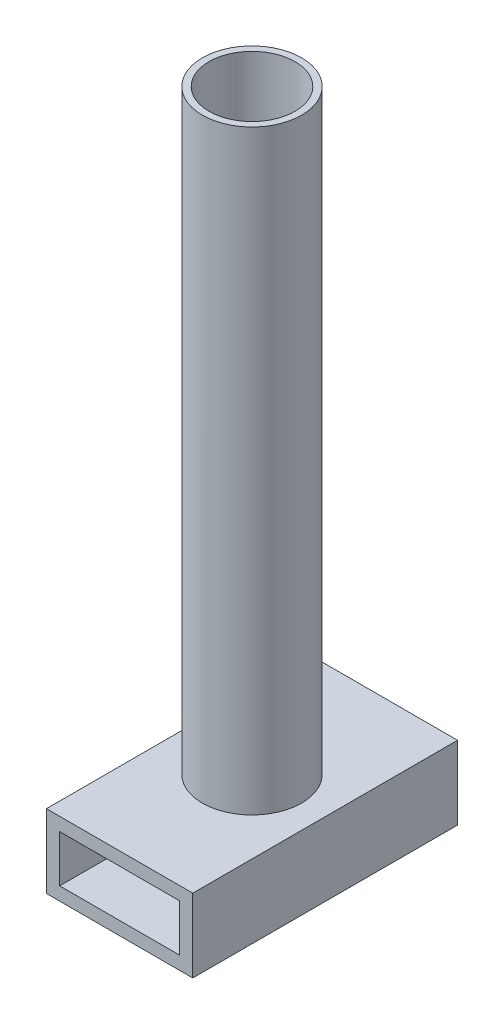
ISO-10303-21;
HEADER;
FILE_DESCRIPTION(('STEP AP214'),'2;1');
FILE_NAME('part.step','',(''),(''),'','','');
FILE_SCHEMA(('AUTOMOTIVE_DESIGN { 1 0 10303 214 1 1 1 1 }'));
ENDSEC;
DATA;
#1=APPLICATION_CONTEXT('core data for automotive mechanical design processes');
#2=APPLICATION_PROTOCOL_DEFINITION('international standard','automotive_design',2000,#1);
#3=PRODUCT_CONTEXT('',#1,'mechanical');
#4=PRODUCT('Part','Part','',(#3));
#5=PRODUCT_RELATED_PRODUCT_CATEGORY('part','',(#4));
#6=PRODUCT_DEFINITION_FORMATION('','',#4);
#7=PRODUCT_DEFINITION_CONTEXT('part definition',#1,'design');
#8=PRODUCT_DEFINITION('design','',#6,#7);
#9=PRODUCT_DEFINITION_SHAPE('','',#8);
#10=(LENGTH_UNIT() NAMED_UNIT(*) SI_UNIT(.MILLI.,.METRE.));
#11=(NAMED_UNIT(*) PLANE_ANGLE_UNIT() SI_UNIT($,.RADIAN.));
#12=(NAMED_UNIT(*) SI_UNIT($,.STERADIAN.) SOLID_ANGLE_UNIT());
#13=UNCERTAINTY_MEASURE_WITH_UNIT(LENGTH_MEASURE(1.E-05),#10,'distance_accuracy_value','');
#14=(GEOMETRIC_REPRESENTATION_CONTEXT(3) GLOBAL_UNCERTAINTY_ASSIGNED_CONTEXT((#13)) GLOBAL_UNIT_ASSIGNED_CONTEXT((#10,
#11,#12)) REPRESENTATION_CONTEXT('',''));
#15=CARTESIAN_POINT('',(0.,0.,0.));
#16=DIRECTION('',(0.,0.,1.));
#17=DIRECTION('',(1.,0.,0.));
#18=AXIS2_PLACEMENT_3D('',#15,#16,#17);
#19=CARTESIAN_POINT('',(-11.05,5.55,40.));
#20=DIRECTION('',(0.,-1.,0.));
#21=DIRECTION('',(0.,0.,-1.));
#22=AXIS2_PLACEMENT_3D('',#19,#20,#21);
#23=PLANE('',#22);
#24=CARTESIAN_POINT('',(0.,5.55,20.));
#25=DIRECTION('',(0.,-1.,0.));
#26=DIRECTION('',(0.,0.,-1.));
#27=AXIS2_PLACEMENT_3D('',#24,#25,#26);
#28=CIRCLE('',#27,1.5);
#29=CARTESIAN_POINT('',(0.,5.55,18.5));
#30=VERTEX_POINT('',#29);
#31=EDGE_CURVE('E140',#30,#30,#28,.T.);
#32=ORIENTED_EDGE('',*,*,#31,.T.);
#33=EDGE_LOOP('',(#32));
#34=FACE_BOUND('',#33,.T.);
#35=CARTESIAN_POINT('',(0.,5.55,20.));
#36=DIRECTION('',(0.,1.,0.));
#37=DIRECTION('',(0.,0.,1.));
#38=AXIS2_PLACEMENT_3D('',#35,#36,#37);
#39=CIRCLE('',#38,6.5);
#40=CARTESIAN_POINT('',(0.,5.55,26.5));
#41=VERTEX_POINT('',#40);
#42=EDGE_CURVE('E351',#41,#41,#39,.T.);
#43=ORIENTED_EDGE('',*,*,#42,.T.);
#44=EDGE_LOOP('',(#43));
#45=FACE_BOUND('',#44,.T.);
#46=ADVANCED_FACE('F39',(#34,#45),#23,.F.);
#47=CARTESIAN_POINT('',(0.,0.,40.));
#48=DIRECTION('',(0.,0.,-1.));
#49=DIRECTION('',(-1.,0.,0.));
#50=AXIS2_PLACEMENT_3D('',#47,#48,#49);
#51=PLANE('',#50);
#52=DIRECTION('',(0.,-1.,0.));
#53=VECTOR('',#52,1.);
#54=CARTESIAN_POINT('',(-11.05,-5.55,40.));
#55=LINE('',#54,#53);
#56=CARTESIAN_POINT('',(-11.05,5.55,40.));
#57=VERTEX_POINT('',#56);
#58=CARTESIAN_POINT('',(-11.05,-5.55,40.));
#59=VERTEX_POINT('',#58);
#60=EDGE_CURVE('E156',#57,#59,#55,.T.);
#61=ORIENTED_EDGE('',*,*,#60,.T.);
#62=DIRECTION('',(1.,0.,0.));
#63=VECTOR('',#62,1.);
#64=CARTESIAN_POINT('',(-11.05,-5.55,40.));
#65=LINE('',#64,#63);
#66=CARTESIAN_POINT('',(11.05,-5.55,40.));
#67=VERTEX_POINT('',#66);
#68=EDGE_CURVE('E160',#59,#67,#65,.T.);
#69=ORIENTED_EDGE('',*,*,#68,.T.);
#70=DIRECTION('',(0.,1.,0.));
#71=VECTOR('',#70,1.);
#72=CARTESIAN_POINT('',(11.05,-5.55,40.));
#73=LINE('',#72,#71);
#74=CARTESIAN_POINT('',(11.05,5.55,40.));
#75=VERTEX_POINT('',#74);
#76=EDGE_CURVE('E164',#67,#75,#73,.T.);
#77=ORIENTED_EDGE('',*,*,#76,.T.);
#78=DIRECTION('',(-1.,0.,0.));
#79=VECTOR('',#78,1.);
#80=CARTESIAN_POINT('',(-11.05,5.55,40.));
#81=LINE('',#80,#79);
#82=EDGE_CURVE('E167',#75,#57,#81,.T.);
#83=ORIENTED_EDGE('',*,*,#82,.T.);
#84=EDGE_LOOP('',(#61,#69,#77,#83));
#85=FACE_BOUND('',#84,.T.);
#86=DIRECTION('',(0.,1.,0.));
#87=VECTOR('',#86,1.);
#88=CARTESIAN_POINT('',(9.05,-3.55,40.));
#89=LINE('',#88,#87);
#90=CARTESIAN_POINT('',(9.05,-3.55,40.));
#91=VERTEX_POINT('',#90);
#92=CARTESIAN_POINT('',(9.05,3.55,40.));
#93=VERTEX_POINT('',#92);
#94=EDGE_CURVE('E105',#91,#93,#89,.T.);
#95=ORIENTED_EDGE('',*,*,#94,.F.);
#96=DIRECTION('',(1.,0.,0.));
#97=VECTOR('',#96,1.);
#98=CARTESIAN_POINT('',(-9.05,-3.55,40.));
#99=LINE('',#98,#97);
#100=CARTESIAN_POINT('',(-9.05,-3.55,40.));
#101=VERTEX_POINT('',#100);
#102=EDGE_CURVE('E132',#101,#91,#99,.T.);
#103=ORIENTED_EDGE('',*,*,#102,.F.);
#104=DIRECTION('',(0.,-1.,0.));
#105=VECTOR('',#104,1.);
#106=CARTESIAN_POINT('',(-9.05,-3.55,40.));
#107=LINE('',#106,#105);
#108=CARTESIAN_POINT('',(-9.05,3.55,40.));
#109=VERTEX_POINT('',#108);
#110=EDGE_CURVE('E128',#109,#101,#107,.T.);
#111=ORIENTED_EDGE('',*,*,#110,.F.);
#112=DIRECTION('',(-1.,0.,0.));
#113=VECTOR('',#112,1.);
#114=CARTESIAN_POINT('',(-9.05,3.55,40.));
#115=LINE('',#114,#113);
#116=EDGE_CURVE('E114',#93,#109,#115,.T.);
#117=ORIENTED_EDGE('',*,*,#116,.F.);
#118=EDGE_LOOP('',(#95,#103,#111,#117));
#119=FACE_BOUND('',#118,.T.);
#120=ADVANCED_FACE('F127',(#85,#119),#51,.F.);
#121=CARTESIAN_POINT('',(0.,0.,0.));
#122=DIRECTION('',(0.,0.,-1.));
#123=DIRECTION('',(-1.,0.,0.));
#124=AXIS2_PLACEMENT_3D('',#121,#122,#123);
#125=PLANE('',#124);
#126=DIRECTION('',(0.,-1.,0.));
#127=VECTOR('',#126,1.);
#128=CARTESIAN_POINT('',(-11.05,-5.55,0.));
#129=LINE('',#128,#127);
#130=CARTESIAN_POINT('',(-11.05,5.55,0.));
#131=VERTEX_POINT('',#130);
#132=CARTESIAN_POINT('',(-11.05,-5.55,0.));
#133=VERTEX_POINT('',#132);
#134=EDGE_CURVE('E123',#131,#133,#129,.T.);
#135=ORIENTED_EDGE('',*,*,#134,.F.);
#136=DIRECTION('',(-1.,0.,0.));
#137=VECTOR('',#136,1.);
#138=CARTESIAN_POINT('',(-11.05,5.55,0.));
#139=LINE('',#138,#137);
#140=CARTESIAN_POINT('',(11.05,5.55,0.));
#141=VERTEX_POINT('',#140);
#142=EDGE_CURVE('E161',#141,#131,#139,.T.);
#143=ORIENTED_EDGE('',*,*,#142,.F.);
#144=DIRECTION('',(0.,1.,0.));
#145=VECTOR('',#144,1.);
#146=CARTESIAN_POINT('',(11.05,-5.55,0.));
#147=LINE('',#146,#145);
#148=CARTESIAN_POINT('',(11.05,-5.55,0.));
#149=VERTEX_POINT('',#148);
#150=EDGE_CURVE('E177',#149,#141,#147,.T.);
#151=ORIENTED_EDGE('',*,*,#150,.F.);
#152=DIRECTION('',(1.,0.,0.));
#153=VECTOR('',#152,1.);
#154=CARTESIAN_POINT('',(-11.05,-5.55,0.));
#155=LINE('',#154,#153);
#156=EDGE_CURVE('E174',#133,#149,#155,.T.);
#157=ORIENTED_EDGE('',*,*,#156,.F.);
#158=EDGE_LOOP('',(#135,#143,#151,#157));
#159=FACE_BOUND('',#158,.T.);
#160=DIRECTION('',(1.,0.,0.));
#161=VECTOR('',#160,1.);
#162=CARTESIAN_POINT('',(-9.05,-3.55,0.));
#163=LINE('',#162,#161);
#164=CARTESIAN_POINT('',(-9.05,-3.55,0.));
#165=VERTEX_POINT('',#164);
#166=CARTESIAN_POINT('',(9.05,-3.55,0.));
#167=VERTEX_POINT('',#166);
#168=EDGE_CURVE('E115',#165,#167,#163,.T.);
#169=ORIENTED_EDGE('',*,*,#168,.T.);
#170=DIRECTION('',(0.,1.,0.));
#171=VECTOR('',#170,1.);
#172=CARTESIAN_POINT('',(9.05,-3.55,0.));
#173=LINE('',#172,#171);
#174=CARTESIAN_POINT('',(9.05,3.55,0.));
#175=VERTEX_POINT('',#174);
#176=EDGE_CURVE('E63',#167,#175,#173,.T.);
#177=ORIENTED_EDGE('',*,*,#176,.T.);
#178=DIRECTION('',(-1.,0.,0.));
#179=VECTOR('',#178,1.);
#180=CARTESIAN_POINT('',(-9.05,3.55,0.));
#181=LINE('',#180,#179);
#182=CARTESIAN_POINT('',(-9.05,3.55,0.));
#183=VERTEX_POINT('',#182);
#184=EDGE_CURVE('E121',#175,#183,#181,.T.);
#185=ORIENTED_EDGE('',*,*,#184,.T.);
#186=DIRECTION('',(0.,-1.,0.));
#187=VECTOR('',#186,1.);
#188=CARTESIAN_POINT('',(-9.05,-3.55,0.));
#189=LINE('',#188,#187);
#190=EDGE_CURVE('E143',#183,#165,#189,.T.);
#191=ORIENTED_EDGE('',*,*,#190,.T.);
#192=EDGE_LOOP('',(#169,#177,#185,#191));
#193=FACE_BOUND('',#192,.T.);
#194=ADVANCED_FACE('F244',(#159,#193),#125,.T.);
#195=CARTESIAN_POINT('',(-11.05,-5.55,40.));
#196=DIRECTION('',(1.,0.,0.));
#197=DIRECTION('',(0.,0.,-1.));
#198=AXIS2_PLACEMENT_3D('',#195,#196,#197);
#199=PLANE('',#198);
#200=ORIENTED_EDGE('',*,*,#134,.T.);
#201=DIRECTION('',(0.,0.,-1.));
#202=VECTOR('',#201,1.);
#203=CARTESIAN_POINT('',(-11.05,-5.55,40.));
#204=LINE('',#203,#202);
#205=EDGE_CURVE('E48',#59,#133,#204,.T.);
#206=ORIENTED_EDGE('',*,*,#205,.F.);
#207=ORIENTED_EDGE('',*,*,#60,.F.);
#208=DIRECTION('',(0.,0.,-1.));
#209=VECTOR('',#208,1.);
#210=CARTESIAN_POINT('',(-11.05,5.55,40.));
#211=LINE('',#210,#209);
#212=EDGE_CURVE('E170',#57,#131,#211,.T.);
#213=ORIENTED_EDGE('',*,*,#212,.T.);
#214=EDGE_LOOP('',(#200,#206,#207,#213));
#215=FACE_BOUND('',#214,.T.);
#216=ADVANCED_FACE('F41',(#215),#199,.F.);
#217=CARTESIAN_POINT('',(-11.05,-5.55,40.));
#218=DIRECTION('',(0.,1.,0.));
#219=DIRECTION('',(0.,0.,1.));
#220=AXIS2_PLACEMENT_3D('',#217,#218,#219);
#221=PLANE('',#220);
#222=CARTESIAN_POINT('',(0.,-5.55,20.));
#223=DIRECTION('',(0.,-1.,0.));
#224=DIRECTION('',(0.,0.,-1.));
#225=AXIS2_PLACEMENT_3D('',#222,#223,#224);
#226=CIRCLE('',#225,1.5);
#227=CARTESIAN_POINT('',(0.,-5.55,18.5));
#228=VERTEX_POINT('',#227);
#229=EDGE_CURVE('E199',#228,#228,#226,.T.);
#230=ORIENTED_EDGE('',*,*,#229,.F.);
#231=EDGE_LOOP('',(#230));
#232=FACE_BOUND('',#231,.T.);
#233=ORIENTED_EDGE('',*,*,#156,.T.);
#234=DIRECTION('',(0.,0.,-1.));
#235=VECTOR('',#234,1.);
#236=CARTESIAN_POINT('',(11.05,-5.55,40.));
#237=LINE('',#236,#235);
#238=EDGE_CURVE('E189',#67,#149,#237,.T.);
#239=ORIENTED_EDGE('',*,*,#238,.F.);
#240=ORIENTED_EDGE('',*,*,#68,.F.);
#241=ORIENTED_EDGE('',*,*,#205,.T.);
#242=EDGE_LOOP('',(#233,#239,#240,#241));
#243=FACE_BOUND('',#242,.T.);
#244=ADVANCED_FACE('F257',(#232,#243),#221,.F.);
#245=CARTESIAN_POINT('',(11.05,-5.55,40.));
#246=DIRECTION('',(-1.,0.,0.));
#247=DIRECTION('',(0.,-1.,0.));
#248=AXIS2_PLACEMENT_3D('',#245,#246,#247);
#249=PLANE('',#248);
#250=ORIENTED_EDGE('',*,*,#150,.T.);
#251=DIRECTION('',(0.,0.,-1.));
#252=VECTOR('',#251,1.);
#253=CARTESIAN_POINT('',(11.05,5.55,40.));
#254=LINE('',#253,#252);
#255=EDGE_CURVE('E185',#75,#141,#254,.T.);
#256=ORIENTED_EDGE('',*,*,#255,.F.);
#257=ORIENTED_EDGE('',*,*,#76,.F.);
#258=ORIENTED_EDGE('',*,*,#238,.T.);
#259=EDGE_LOOP('',(#250,#256,#257,#258));
#260=FACE_BOUND('',#259,.T.);
#261=ADVANCED_FACE('F250',(#260),#249,.F.);
#262=CARTESIAN_POINT('',(0.,5.55,20.));
#263=DIRECTION('',(0.,-1.,0.));
#264=DIRECTION('',(0.,0.,-1.));
#265=AXIS2_PLACEMENT_3D('',#262,#263,#264);
#266=CIRCLE('',#265,7.5);
#267=CARTESIAN_POINT('',(0.,5.55,12.5));
#268=VERTEX_POINT('',#267);
#269=EDGE_CURVE('E11',#268,#268,#266,.F.);
#270=ORIENTED_EDGE('',*,*,#269,.F.);
#271=EDGE_LOOP('',(#270));
#272=FACE_BOUND('',#271,.T.);
#273=ORIENTED_EDGE('',*,*,#142,.T.);
#274=ORIENTED_EDGE('',*,*,#212,.F.);
#275=ORIENTED_EDGE('',*,*,#82,.F.);
#276=ORIENTED_EDGE('',*,*,#255,.T.);
#277=EDGE_LOOP('',(#273,#274,#275,#276));
#278=FACE_BOUND('',#277,.T.);
#279=ADVANCED_FACE('F240',(#272,#278),#23,.F.);
#280=CARTESIAN_POINT('',(9.05,-3.55,40.));
#281=DIRECTION('',(-1.,0.,0.));
#282=DIRECTION('',(0.,0.,1.));
#283=AXIS2_PLACEMENT_3D('',#280,#281,#282);
#284=PLANE('',#283);
#285=ORIENTED_EDGE('',*,*,#176,.F.);
#286=DIRECTION('',(0.,0.,-1.));
#287=VECTOR('',#286,1.);
#288=CARTESIAN_POINT('',(9.05,-3.55,40.));
#289=LINE('',#288,#287);
#290=EDGE_CURVE('E109',#91,#167,#289,.T.);
#291=ORIENTED_EDGE('',*,*,#290,.F.);
#292=ORIENTED_EDGE('',*,*,#94,.T.);
#293=DIRECTION('',(0.,0.,-1.));
#294=VECTOR('',#293,1.);
#295=CARTESIAN_POINT('',(9.05,3.55,40.));
#296=LINE('',#295,#294);
#297=EDGE_CURVE('E108',#93,#175,#296,.T.);
#298=ORIENTED_EDGE('',*,*,#297,.T.);
#299=EDGE_LOOP('',(#285,#291,#292,#298));
#300=FACE_BOUND('',#299,.T.);
#301=ADVANCED_FACE('F107',(#300),#284,.T.);
#302=CARTESIAN_POINT('',(-9.05,3.55,40.));
#303=DIRECTION('',(0.,-1.,0.));
#304=DIRECTION('',(0.,0.,-1.));
#305=AXIS2_PLACEMENT_3D('',#302,#303,#304);
#306=PLANE('',#305);
#307=CARTESIAN_POINT('',(0.,3.55,20.));
#308=DIRECTION('',(0.,-1.,0.));
#309=DIRECTION('',(0.,0.,-1.));
#310=AXIS2_PLACEMENT_3D('',#307,#308,#309);
#311=CIRCLE('',#310,1.5);
#312=CARTESIAN_POINT('',(0.,3.55,18.5));
#313=VERTEX_POINT('',#312);
#314=EDGE_CURVE('E198',#313,#313,#311,.T.);
#315=ORIENTED_EDGE('',*,*,#314,.F.);
#316=EDGE_LOOP('',(#315));
#317=FACE_BOUND('',#316,.T.);
#318=ORIENTED_EDGE('',*,*,#184,.F.);
#319=ORIENTED_EDGE('',*,*,#297,.F.);
#320=ORIENTED_EDGE('',*,*,#116,.T.);
#321=DIRECTION('',(0.,0.,-1.));
#322=VECTOR('',#321,1.);
#323=CARTESIAN_POINT('',(-9.05,3.55,40.));
#324=LINE('',#323,#322);
#325=EDGE_CURVE('E124',#109,#183,#324,.T.);
#326=ORIENTED_EDGE('',*,*,#325,.T.);
#327=EDGE_LOOP('',(#318,#319,#320,#326));
#328=FACE_BOUND('',#327,.T.);
#329=ADVANCED_FACE('F118',(#317,#328),#306,.T.);
#330=CARTESIAN_POINT('',(-9.05,-3.55,40.));
#331=DIRECTION('',(1.,0.,0.));
#332=DIRECTION('',(0.,0.,-1.));
#333=AXIS2_PLACEMENT_3D('',#330,#331,#332);
#334=PLANE('',#333);
#335=ORIENTED_EDGE('',*,*,#190,.F.);
#336=ORIENTED_EDGE('',*,*,#325,.F.);
#337=ORIENTED_EDGE('',*,*,#110,.T.);
#338=DIRECTION('',(0.,0.,-1.));
#339=VECTOR('',#338,1.);
#340=CARTESIAN_POINT('',(-9.05,-3.55,40.));
#341=LINE('',#340,#339);
#342=EDGE_CURVE('E55',#101,#165,#341,.T.);
#343=ORIENTED_EDGE('',*,*,#342,.T.);
#344=EDGE_LOOP('',(#335,#336,#337,#343));
#345=FACE_BOUND('',#344,.T.);
#346=ADVANCED_FACE('F288',(#345),#334,.T.);
#347=CARTESIAN_POINT('',(-9.05,-3.55,40.));
#348=DIRECTION('',(0.,1.,0.));
#349=DIRECTION('',(0.,0.,1.));
#350=AXIS2_PLACEMENT_3D('',#347,#348,#349);
#351=PLANE('',#350);
#352=CARTESIAN_POINT('',(0.,-3.55,20.));
#353=DIRECTION('',(0.,1.,0.));
#354=DIRECTION('',(0.,0.,1.));
#355=AXIS2_PLACEMENT_3D('',#352,#353,#354);
#356=CIRCLE('',#355,1.5);
#357=CARTESIAN_POINT('',(0.,-3.55,21.5));
#358=VERTEX_POINT('',#357);
#359=EDGE_CURVE('E195',#358,#358,#356,.T.);
#360=ORIENTED_EDGE('',*,*,#359,.F.);
#361=EDGE_LOOP('',(#360));
#362=FACE_BOUND('',#361,.T.);
#363=ORIENTED_EDGE('',*,*,#168,.F.);
#364=ORIENTED_EDGE('',*,*,#342,.F.);
#365=ORIENTED_EDGE('',*,*,#102,.T.);
#366=ORIENTED_EDGE('',*,*,#290,.T.);
#367=EDGE_LOOP('',(#363,#364,#365,#366));
#368=FACE_BOUND('',#367,.T.);
#369=ADVANCED_FACE('F235',(#362,#368),#351,.T.);
#370=CARTESIAN_POINT('',(0.,27.45,20.));
#371=DIRECTION('',(0.,-1.,0.));
#372=DIRECTION('',(0.,0.,-1.));
#373=AXIS2_PLACEMENT_3D('',#370,#371,#372);
#374=CYLINDRICAL_SURFACE('',#373,1.5);
#375=ORIENTED_EDGE('',*,*,#359,.T.);
#376=EDGE_LOOP('',(#375));
#377=FACE_BOUND('',#376,.T.);
#378=ORIENTED_EDGE('',*,*,#229,.T.);
#379=EDGE_LOOP('',(#378));
#380=FACE_BOUND('',#379,.T.);
#381=ADVANCED_FACE('F225',(#377,#380),#374,.F.);
#382=ORIENTED_EDGE('',*,*,#314,.T.);
#383=EDGE_LOOP('',(#382));
#384=FACE_BOUND('',#383,.T.);
#385=ORIENTED_EDGE('',*,*,#31,.F.);
#386=EDGE_LOOP('',(#385));
#387=FACE_BOUND('',#386,.T.);
#388=ADVANCED_FACE('F222',(#384,#387),#374,.F.);
#389=CARTESIAN_POINT('',(0.,95.55,20.));
#390=DIRECTION('',(0.,1.,0.));
#391=DIRECTION('',(0.,0.,1.));
#392=AXIS2_PLACEMENT_3D('',#389,#390,#391);
#393=PLANE('',#392);
#394=CARTESIAN_POINT('',(0.,95.55,20.));
#395=DIRECTION('',(0.,1.,0.));
#396=DIRECTION('',(0.,0.,1.));
#397=AXIS2_PLACEMENT_3D('',#394,#395,#396);
#398=CIRCLE('',#397,7.5);
#399=CARTESIAN_POINT('',(0.,95.55,27.5));
#400=VERTEX_POINT('',#399);
#401=EDGE_CURVE('E207',#400,#400,#398,.T.);
#402=ORIENTED_EDGE('',*,*,#401,.T.);
#403=EDGE_LOOP('',(#402));
#404=FACE_BOUND('',#403,.T.);
#405=CARTESIAN_POINT('',(0.,95.55,20.));
#406=DIRECTION('',(0.,1.,0.));
#407=DIRECTION('',(0.,0.,1.));
#408=AXIS2_PLACEMENT_3D('',#405,#406,#407);
#409=CIRCLE('',#408,6.5);
#410=CARTESIAN_POINT('',(0.,95.55,26.5));
#411=VERTEX_POINT('',#410);
#412=EDGE_CURVE('E213',#411,#411,#409,.T.);
#413=ORIENTED_EDGE('',*,*,#412,.F.);
#414=EDGE_LOOP('',(#413));
#415=FACE_BOUND('',#414,.T.);
#416=ADVANCED_FACE('F224',(#404,#415),#393,.T.);
#417=CARTESIAN_POINT('',(0.,95.55,20.));
#418=DIRECTION('',(0.,-1.,0.));
#419=DIRECTION('',(0.,0.,-1.));
#420=AXIS2_PLACEMENT_3D('',#417,#418,#419);
#421=CYLINDRICAL_SURFACE('',#420,7.5);
#422=ORIENTED_EDGE('',*,*,#401,.F.);
#423=EDGE_LOOP('',(#422));
#424=FACE_BOUND('',#423,.T.);
#425=ORIENTED_EDGE('',*,*,#269,.T.);
#426=EDGE_LOOP('',(#425));
#427=FACE_BOUND('',#426,.T.);
#428=ADVANCED_FACE('F232',(#424,#427),#421,.T.);
#429=CARTESIAN_POINT('',(0.,95.55,20.));
#430=DIRECTION('',(0.,-1.,0.));
#431=DIRECTION('',(0.,0.,-1.));
#432=AXIS2_PLACEMENT_3D('',#429,#430,#431);
#433=CYLINDRICAL_SURFACE('',#432,6.5);
#434=ORIENTED_EDGE('',*,*,#412,.T.);
#435=EDGE_LOOP('',(#434));
#436=FACE_BOUND('',#435,.T.);
#437=ORIENTED_EDGE('',*,*,#42,.F.);
#438=EDGE_LOOP('',(#437));
#439=FACE_BOUND('',#438,.T.);
#440=ADVANCED_FACE('F333',(#436,#439),#433,.F.);
#441=CLOSED_SHELL('',(#46,#120,#194,#216,#244,#261,#279,#301,#329,#346,#369,#381,#388,#416,#428,#440));
#442=MANIFOLD_SOLID_BREP('B2',#441);
#443=ADVANCED_BREP_SHAPE_REPRESENTATION('',(#18,#442),#14);
#444=SHAPE_DEFINITION_REPRESENTATION(#9,#443);
ENDSEC;
END-ISO-10303-21;
